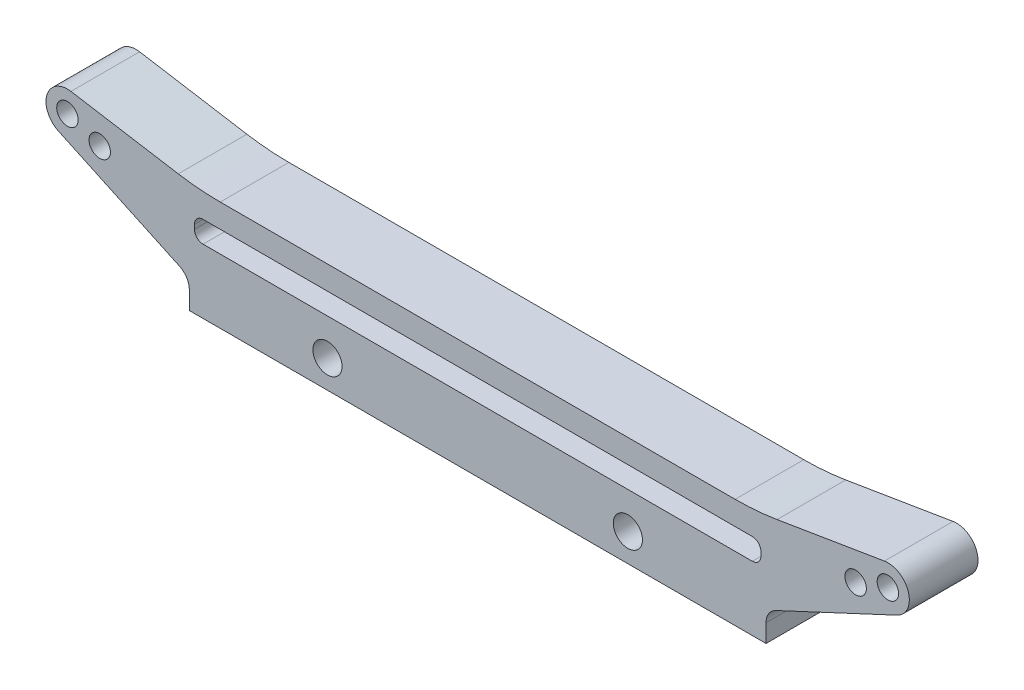
ISO-10303-21;
HEADER;
FILE_DESCRIPTION(('STEP AP214'),'2;1');
FILE_NAME('part.step','',(''),(''),'','','');
FILE_SCHEMA(('AUTOMOTIVE_DESIGN { 1 0 10303 214 1 1 1 1 }'));
ENDSEC;
DATA;
#1=APPLICATION_CONTEXT('core data for automotive mechanical design processes');
#2=APPLICATION_PROTOCOL_DEFINITION('international standard','automotive_design',2000,#1);
#3=PRODUCT_CONTEXT('',#1,'mechanical');
#4=PRODUCT('Part','Part','',(#3));
#5=PRODUCT_RELATED_PRODUCT_CATEGORY('part','',(#4));
#6=PRODUCT_DEFINITION_FORMATION('','',#4);
#7=PRODUCT_DEFINITION_CONTEXT('part definition',#1,'design');
#8=PRODUCT_DEFINITION('design','',#6,#7);
#9=PRODUCT_DEFINITION_SHAPE('','',#8);
#10=(LENGTH_UNIT() NAMED_UNIT(*) SI_UNIT(.MILLI.,.METRE.));
#11=(NAMED_UNIT(*) PLANE_ANGLE_UNIT() SI_UNIT($,.RADIAN.));
#12=(NAMED_UNIT(*) SI_UNIT($,.STERADIAN.) SOLID_ANGLE_UNIT());
#13=UNCERTAINTY_MEASURE_WITH_UNIT(LENGTH_MEASURE(1.E-05),#10,'distance_accuracy_value','');
#14=(GEOMETRIC_REPRESENTATION_CONTEXT(3) GLOBAL_UNCERTAINTY_ASSIGNED_CONTEXT((#13)) GLOBAL_UNIT_ASSIGNED_CONTEXT((#10,
#11,#12)) REPRESENTATION_CONTEXT('',''));
#15=CARTESIAN_POINT('',(0.,0.,0.));
#16=DIRECTION('',(0.,0.,1.));
#17=DIRECTION('',(1.,0.,0.));
#18=AXIS2_PLACEMENT_3D('',#15,#16,#17);
#19=CARTESIAN_POINT('',(-35.6,2.34584593517792,8.));
#20=DIRECTION('',(0.,0.,-1.));
#21=DIRECTION('',(-1.,0.,0.));
#22=AXIS2_PLACEMENT_3D('',#19,#20,#21);
#23=PLANE('',#22);
#24=CARTESIAN_POINT('',(-47.8,13.,8.));
#25=DIRECTION('',(0.,0.,1.));
#26=DIRECTION('',(1.,0.,0.));
#27=AXIS2_PLACEMENT_3D('',#24,#25,#26);
#28=CIRCLE('',#27,1.24999999999999);
#29=CARTESIAN_POINT('',(-46.55,13.,8.));
#30=VERTEX_POINT('',#29);
#31=EDGE_CURVE('E319',#30,#30,#28,.T.);
#32=ORIENTED_EDGE('',*,*,#31,.F.);
#33=EDGE_LOOP('',(#32));
#34=FACE_BOUND('',#33,.T.);
#35=CARTESIAN_POINT('',(47.8,13.,8.));
#36=DIRECTION('',(0.,0.,1.));
#37=DIRECTION('',(1.,0.,0.));
#38=AXIS2_PLACEMENT_3D('',#35,#36,#37);
#39=CIRCLE('',#38,1.24999999999999);
#40=CARTESIAN_POINT('',(49.05,13.,8.));
#41=VERTEX_POINT('',#40);
#42=EDGE_CURVE('E327',#41,#41,#39,.T.);
#43=ORIENTED_EDGE('',*,*,#42,.F.);
#44=EDGE_LOOP('',(#43));
#45=FACE_BOUND('',#44,.T.);
#46=CARTESIAN_POINT('',(-44.0412295168564,11.6319194266973,8.));
#47=DIRECTION('',(0.,0.,1.));
#48=DIRECTION('',(1.,0.,0.));
#49=AXIS2_PLACEMENT_3D('',#46,#47,#48);
#50=CIRCLE('',#49,1.24999999999999);
#51=CARTESIAN_POINT('',(-42.7912295168564,11.6319194266973,8.));
#52=VERTEX_POINT('',#51);
#53=EDGE_CURVE('E333',#52,#52,#50,.T.);
#54=ORIENTED_EDGE('',*,*,#53,.F.);
#55=EDGE_LOOP('',(#54));
#56=FACE_BOUND('',#55,.T.);
#57=CARTESIAN_POINT('',(44.0412295168564,11.6319194266973,8.));
#58=DIRECTION('',(0.,0.,1.));
#59=DIRECTION('',(1.,0.,0.));
#60=AXIS2_PLACEMENT_3D('',#57,#58,#59);
#61=CIRCLE('',#60,1.24999999999999);
#62=CARTESIAN_POINT('',(45.2912295168564,11.6319194266973,8.));
#63=VERTEX_POINT('',#62);
#64=EDGE_CURVE('E339',#63,#63,#61,.T.);
#65=ORIENTED_EDGE('',*,*,#64,.F.);
#66=EDGE_LOOP('',(#65));
#67=FACE_BOUND('',#66,.T.);
#68=CARTESIAN_POINT('',(-17.5,3.5,8.));
#69=DIRECTION('',(0.,0.,1.));
#70=DIRECTION('',(1.,0.,0.));
#71=AXIS2_PLACEMENT_3D('',#68,#69,#70);
#72=CIRCLE('',#71,1.7);
#73=CARTESIAN_POINT('',(-15.8,3.5,8.));
#74=VERTEX_POINT('',#73);
#75=EDGE_CURVE('E345',#74,#74,#72,.T.);
#76=ORIENTED_EDGE('',*,*,#75,.F.);
#77=EDGE_LOOP('',(#76));
#78=FACE_BOUND('',#77,.T.);
#79=CARTESIAN_POINT('',(17.5,3.5,8.));
#80=DIRECTION('',(0.,0.,1.));
#81=DIRECTION('',(1.,0.,0.));
#82=AXIS2_PLACEMENT_3D('',#79,#80,#81);
#83=CIRCLE('',#82,1.7);
#84=CARTESIAN_POINT('',(19.2,3.5,8.));
#85=VERTEX_POINT('',#84);
#86=EDGE_CURVE('E351',#85,#85,#83,.T.);
#87=ORIENTED_EDGE('',*,*,#86,.F.);
#88=EDGE_LOOP('',(#87));
#89=FACE_BOUND('',#88,.T.);
#90=DIRECTION('',(0.,-1.,0.));
#91=VECTOR('',#90,1.);
#92=CARTESIAN_POINT('',(-33.6,0.,8.));
#93=LINE('',#92,#91);
#94=CARTESIAN_POINT('',(-33.6,2.34584593517792,8.));
#95=VERTEX_POINT('',#94);
#96=CARTESIAN_POINT('',(-33.6,0.25,8.));
#97=VERTEX_POINT('',#96);
#98=EDGE_CURVE('E310',#95,#97,#93,.T.);
#99=ORIENTED_EDGE('',*,*,#98,.T.);
#100=DIRECTION('',(-1.,0.,0.));
#101=VECTOR('',#100,1.);
#102=CARTESIAN_POINT('',(-33.6,0.25,8.));
#103=LINE('',#102,#101);
#104=CARTESIAN_POINT('',(33.6,0.25,8.));
#105=VERTEX_POINT('',#104);
#106=EDGE_CURVE('E184',#105,#97,#103,.T.);
#107=ORIENTED_EDGE('',*,*,#106,.F.);
#108=DIRECTION('',(0.,1.,0.));
#109=VECTOR('',#108,1.);
#110=CARTESIAN_POINT('',(33.6,0.,8.));
#111=LINE('',#110,#109);
#112=CARTESIAN_POINT('',(33.6,2.34584593517792,8.));
#113=VERTEX_POINT('',#112);
#114=EDGE_CURVE('E312',#105,#113,#111,.T.);
#115=ORIENTED_EDGE('',*,*,#114,.T.);
#116=CARTESIAN_POINT('',(35.6,2.34584593517792,8.));
#117=DIRECTION('',(0.,0.,-1.));
#118=DIRECTION('',(1.,0.,0.));
#119=AXIS2_PLACEMENT_3D('',#116,#117,#118);
#120=CIRCLE('',#119,2.);
#121=CARTESIAN_POINT('',(34.7547634765186,4.15846150925123,8.));
#122=VERTEX_POINT('',#121);
#123=EDGE_CURVE('E266',#113,#122,#120,.T.);
#124=ORIENTED_EDGE('',*,*,#123,.T.);
#125=DIRECTION('',(0.906307787036653,0.422618261740694,0.));
#126=VECTOR('',#125,1.);
#127=CARTESIAN_POINT('',(34.7547634765186,4.15846150925123,8.));
#128=LINE('',#127,#126);
#129=CARTESIAN_POINT('',(48.8565456543517,10.7342305324084,8.));
#130=VERTEX_POINT('',#129);
#131=EDGE_CURVE('E284',#122,#130,#128,.T.);
#132=ORIENTED_EDGE('',*,*,#131,.T.);
#133=CARTESIAN_POINT('',(47.8,13.,8.));
#134=DIRECTION('',(0.,0.,1.));
#135=DIRECTION('',(-1.,0.,0.));
#136=AXIS2_PLACEMENT_3D('',#133,#134,#135);
#137=CIRCLE('',#136,2.5);
#138=CARTESIAN_POINT('',(47.3925354388118,15.4665710270283,8.));
#139=VERTEX_POINT('',#138);
#140=EDGE_CURVE('E280',#130,#139,#137,.T.);
#141=ORIENTED_EDGE('',*,*,#140,.T.);
#142=DIRECTION('',(-0.986628410811345,-0.162985824475262,0.));
#143=VECTOR('',#142,1.);
#144=CARTESIAN_POINT('',(47.3925354388118,15.4665710270283,8.));
#145=LINE('',#144,#143);
#146=CARTESIAN_POINT('',(34.8895747342579,13.4011476756597,8.));
#147=VERTEX_POINT('',#146);
#148=EDGE_CURVE('E283',#139,#147,#145,.T.);
#149=ORIENTED_EDGE('',*,*,#148,.T.);
#150=CARTESIAN_POINT('',(30.,43.,8.));
#151=DIRECTION('',(0.,0.,-1.));
#152=DIRECTION('',(-1.,0.,0.));
#153=AXIS2_PLACEMENT_3D('',#150,#151,#152);
#154=CIRCLE('',#153,30.);
#155=CARTESIAN_POINT('',(30.,13.,8.));
#156=VERTEX_POINT('',#155);
#157=EDGE_CURVE('E286',#147,#156,#154,.T.);
#158=ORIENTED_EDGE('',*,*,#157,.T.);
#159=DIRECTION('',(-1.,0.,0.));
#160=VECTOR('',#159,1.);
#161=CARTESIAN_POINT('',(-30.,13.,8.));
#162=LINE('',#161,#160);
#163=CARTESIAN_POINT('',(-30.,13.,8.));
#164=VERTEX_POINT('',#163);
#165=EDGE_CURVE('E292',#156,#164,#162,.T.);
#166=ORIENTED_EDGE('',*,*,#165,.T.);
#167=CARTESIAN_POINT('',(-30.,43.,8.));
#168=DIRECTION('',(0.,0.,-1.));
#169=DIRECTION('',(1.,0.,0.));
#170=AXIS2_PLACEMENT_3D('',#167,#168,#169);
#171=CIRCLE('',#170,30.);
#172=CARTESIAN_POINT('',(-34.8895747342579,13.4011476756597,8.));
#173=VERTEX_POINT('',#172);
#174=EDGE_CURVE('E294',#164,#173,#171,.T.);
#175=ORIENTED_EDGE('',*,*,#174,.T.);
#176=DIRECTION('',(-0.986628410811345,0.162985824475262,0.));
#177=VECTOR('',#176,1.);
#178=CARTESIAN_POINT('',(-47.3925354388118,15.4665710270283,8.));
#179=LINE('',#178,#177);
#180=CARTESIAN_POINT('',(-47.3925354388118,15.4665710270284,8.));
#181=VERTEX_POINT('',#180);
#182=EDGE_CURVE('E296',#173,#181,#179,.T.);
#183=ORIENTED_EDGE('',*,*,#182,.T.);
#184=CARTESIAN_POINT('',(-47.8,13.,8.));
#185=DIRECTION('',(0.,0.,1.));
#186=DIRECTION('',(1.,0.,0.));
#187=AXIS2_PLACEMENT_3D('',#184,#185,#186);
#188=CIRCLE('',#187,2.5);
#189=CARTESIAN_POINT('',(-48.8565456543517,10.7342305324084,8.));
#190=VERTEX_POINT('',#189);
#191=EDGE_CURVE('E298',#181,#190,#188,.T.);
#192=ORIENTED_EDGE('',*,*,#191,.T.);
#193=DIRECTION('',(0.906307787036653,-0.422618261740694,0.));
#194=VECTOR('',#193,1.);
#195=CARTESIAN_POINT('',(-34.7547634765186,4.15846150925123,8.));
#196=LINE('',#195,#194);
#197=CARTESIAN_POINT('',(-34.7547634765186,4.15846150925123,8.));
#198=VERTEX_POINT('',#197);
#199=EDGE_CURVE('E234',#190,#198,#196,.T.);
#200=ORIENTED_EDGE('',*,*,#199,.T.);
#201=CARTESIAN_POINT('',(-35.6,2.34584593517792,8.));
#202=DIRECTION('',(0.,0.,-1.));
#203=DIRECTION('',(-1.,0.,0.));
#204=AXIS2_PLACEMENT_3D('',#201,#202,#203);
#205=CIRCLE('',#204,2.);
#206=EDGE_CURVE('E229',#198,#95,#205,.T.);
#207=ORIENTED_EDGE('',*,*,#206,.T.);
#208=EDGE_LOOP('',(#99,#107,#115,#124,#132,#141,#149,#158,#166,#175,#183,#192,#200,#207));
#209=FACE_BOUND('',#208,.T.);
#210=CARTESIAN_POINT('',(-32.,9.25000000000001,8.));
#211=DIRECTION('',(0.,0.,1.));
#212=DIRECTION('',(1.,0.,0.));
#213=AXIS2_PLACEMENT_3D('',#210,#211,#212);
#214=CIRCLE('',#213,1.);
#215=CARTESIAN_POINT('',(-32.,10.25,8.));
#216=VERTEX_POINT('',#215);
#217=CARTESIAN_POINT('',(-33.,9.25000000000001,8.));
#218=VERTEX_POINT('',#217);
#219=EDGE_CURVE('E358',#216,#218,#214,.T.);
#220=ORIENTED_EDGE('',*,*,#219,.F.);
#221=DIRECTION('',(-1.,0.,0.));
#222=VECTOR('',#221,1.);
#223=CARTESIAN_POINT('',(-32.,10.25,8.));
#224=LINE('',#223,#222);
#225=CARTESIAN_POINT('',(32.,10.25,8.));
#226=VERTEX_POINT('',#225);
#227=EDGE_CURVE('E373',#226,#216,#224,.T.);
#228=ORIENTED_EDGE('',*,*,#227,.F.);
#229=CARTESIAN_POINT('',(32.,9.25000000000001,8.));
#230=DIRECTION('',(0.,0.,1.));
#231=DIRECTION('',(-1.,0.,0.));
#232=AXIS2_PLACEMENT_3D('',#229,#230,#231);
#233=CIRCLE('',#232,1.);
#234=CARTESIAN_POINT('',(33.,9.25000000000001,8.));
#235=VERTEX_POINT('',#234);
#236=EDGE_CURVE('E371',#235,#226,#233,.T.);
#237=ORIENTED_EDGE('',*,*,#236,.F.);
#238=DIRECTION('',(0.,1.,0.));
#239=VECTOR('',#238,1.);
#240=CARTESIAN_POINT('',(33.,8.75,8.));
#241=LINE('',#240,#239);
#242=CARTESIAN_POINT('',(33.,8.75,8.));
#243=VERTEX_POINT('',#242);
#244=EDGE_CURVE('E369',#243,#235,#241,.T.);
#245=ORIENTED_EDGE('',*,*,#244,.F.);
#246=CARTESIAN_POINT('',(32.,8.75,8.));
#247=DIRECTION('',(0.,0.,1.));
#248=DIRECTION('',(1.,0.,0.));
#249=AXIS2_PLACEMENT_3D('',#246,#247,#248);
#250=CIRCLE('',#249,1.);
#251=CARTESIAN_POINT('',(32.,7.75,8.));
#252=VERTEX_POINT('',#251);
#253=EDGE_CURVE('E367',#252,#243,#250,.T.);
#254=ORIENTED_EDGE('',*,*,#253,.F.);
#255=DIRECTION('',(1.,0.,0.));
#256=VECTOR('',#255,1.);
#257=CARTESIAN_POINT('',(32.,7.75,8.));
#258=LINE('',#257,#256);
#259=CARTESIAN_POINT('',(-32.,7.75,8.));
#260=VERTEX_POINT('',#259);
#261=EDGE_CURVE('E365',#260,#252,#258,.T.);
#262=ORIENTED_EDGE('',*,*,#261,.F.);
#263=CARTESIAN_POINT('',(-32.,8.75,8.));
#264=DIRECTION('',(0.,0.,1.));
#265=DIRECTION('',(-1.,0.,0.));
#266=AXIS2_PLACEMENT_3D('',#263,#264,#265);
#267=CIRCLE('',#266,1.);
#268=CARTESIAN_POINT('',(-33.,8.75,8.));
#269=VERTEX_POINT('',#268);
#270=EDGE_CURVE('E363',#269,#260,#267,.T.);
#271=ORIENTED_EDGE('',*,*,#270,.F.);
#272=DIRECTION('',(0.,-1.,0.));
#273=VECTOR('',#272,1.);
#274=CARTESIAN_POINT('',(-33.,8.75,8.));
#275=LINE('',#274,#273);
#276=EDGE_CURVE('E360',#218,#269,#275,.T.);
#277=ORIENTED_EDGE('',*,*,#276,.F.);
#278=EDGE_LOOP('',(#220,#228,#237,#245,#254,#262,#271,#277));
#279=FACE_BOUND('',#278,.T.);
#280=ADVANCED_FACE('F34',(#34,#45,#56,#67,#78,#89,#209,#279),#23,.F.);
#281=CARTESIAN_POINT('',(-35.6,2.34584593517792,0.));
#282=DIRECTION('',(0.,0.,-1.));
#283=DIRECTION('',(-1.,0.,0.));
#284=AXIS2_PLACEMENT_3D('',#281,#282,#283);
#285=PLANE('',#284);
#286=DIRECTION('',(1.,0.,0.));
#287=VECTOR('',#286,1.);
#288=CARTESIAN_POINT('',(-33.6,0.25,0.));
#289=LINE('',#288,#287);
#290=CARTESIAN_POINT('',(-33.6,0.25,0.));
#291=VERTEX_POINT('',#290);
#292=CARTESIAN_POINT('',(33.6,0.25,0.));
#293=VERTEX_POINT('',#292);
#294=EDGE_CURVE('E49',#291,#293,#289,.T.);
#295=ORIENTED_EDGE('',*,*,#294,.F.);
#296=DIRECTION('',(0.,-1.,0.));
#297=VECTOR('',#296,1.);
#298=CARTESIAN_POINT('',(-33.6,0.,0.));
#299=LINE('',#298,#297);
#300=CARTESIAN_POINT('',(-33.6,2.34584593517792,0.));
#301=VERTEX_POINT('',#300);
#302=EDGE_CURVE('E194',#301,#291,#299,.T.);
#303=ORIENTED_EDGE('',*,*,#302,.F.);
#304=CARTESIAN_POINT('',(-35.6,2.34584593517792,0.));
#305=DIRECTION('',(0.,0.,-1.));
#306=DIRECTION('',(-1.,0.,0.));
#307=AXIS2_PLACEMENT_3D('',#304,#305,#306);
#308=CIRCLE('',#307,2.);
#309=CARTESIAN_POINT('',(-34.7547634765186,4.15846150925123,0.));
#310=VERTEX_POINT('',#309);
#311=EDGE_CURVE('E202',#310,#301,#308,.T.);
#312=ORIENTED_EDGE('',*,*,#311,.F.);
#313=DIRECTION('',(0.906307787036653,-0.422618261740694,0.));
#314=VECTOR('',#313,1.);
#315=CARTESIAN_POINT('',(-34.7547634765186,4.15846150925123,0.));
#316=LINE('',#315,#314);
#317=CARTESIAN_POINT('',(-48.8565456543517,10.7342305324084,0.));
#318=VERTEX_POINT('',#317);
#319=EDGE_CURVE('E227',#318,#310,#316,.T.);
#320=ORIENTED_EDGE('',*,*,#319,.F.);
#321=CARTESIAN_POINT('',(-47.8,13.,0.));
#322=DIRECTION('',(0.,0.,1.));
#323=DIRECTION('',(1.,0.,0.));
#324=AXIS2_PLACEMENT_3D('',#321,#322,#323);
#325=CIRCLE('',#324,2.5);
#326=CARTESIAN_POINT('',(-47.3925354388118,15.4665710270284,0.));
#327=VERTEX_POINT('',#326);
#328=EDGE_CURVE('E225',#327,#318,#325,.T.);
#329=ORIENTED_EDGE('',*,*,#328,.F.);
#330=DIRECTION('',(-0.986628410811345,0.162985824475262,0.));
#331=VECTOR('',#330,1.);
#332=CARTESIAN_POINT('',(-47.3925354388118,15.4665710270283,0.));
#333=LINE('',#332,#331);
#334=CARTESIAN_POINT('',(-34.8895747342579,13.4011476756597,0.));
#335=VERTEX_POINT('',#334);
#336=EDGE_CURVE('E223',#335,#327,#333,.T.);
#337=ORIENTED_EDGE('',*,*,#336,.F.);
#338=CARTESIAN_POINT('',(-30.,43.,0.));
#339=DIRECTION('',(0.,0.,-1.));
#340=DIRECTION('',(1.,0.,0.));
#341=AXIS2_PLACEMENT_3D('',#338,#339,#340);
#342=CIRCLE('',#341,30.);
#343=CARTESIAN_POINT('',(-30.,13.,0.));
#344=VERTEX_POINT('',#343);
#345=EDGE_CURVE('E221',#344,#335,#342,.T.);
#346=ORIENTED_EDGE('',*,*,#345,.F.);
#347=DIRECTION('',(-1.,0.,0.));
#348=VECTOR('',#347,1.);
#349=CARTESIAN_POINT('',(-30.,13.,0.));
#350=LINE('',#349,#348);
#351=CARTESIAN_POINT('',(30.,13.,0.));
#352=VERTEX_POINT('',#351);
#353=EDGE_CURVE('E219',#352,#344,#350,.T.);
#354=ORIENTED_EDGE('',*,*,#353,.F.);
#355=CARTESIAN_POINT('',(30.,43.,0.));
#356=DIRECTION('',(0.,0.,-1.));
#357=DIRECTION('',(-1.,0.,0.));
#358=AXIS2_PLACEMENT_3D('',#355,#356,#357);
#359=CIRCLE('',#358,30.);
#360=CARTESIAN_POINT('',(34.8895747342579,13.4011476756597,0.));
#361=VERTEX_POINT('',#360);
#362=EDGE_CURVE('E217',#361,#352,#359,.T.);
#363=ORIENTED_EDGE('',*,*,#362,.F.);
#364=DIRECTION('',(-0.986628410811345,-0.162985824475262,0.));
#365=VECTOR('',#364,1.);
#366=CARTESIAN_POINT('',(47.3925354388118,15.4665710270283,0.));
#367=LINE('',#366,#365);
#368=CARTESIAN_POINT('',(47.3925354388118,15.4665710270283,0.));
#369=VERTEX_POINT('',#368);
#370=EDGE_CURVE('E215',#369,#361,#367,.T.);
#371=ORIENTED_EDGE('',*,*,#370,.F.);
#372=CARTESIAN_POINT('',(47.8,13.,0.));
#373=DIRECTION('',(0.,0.,1.));
#374=DIRECTION('',(-1.,0.,0.));
#375=AXIS2_PLACEMENT_3D('',#372,#373,#374);
#376=CIRCLE('',#375,2.5);
#377=CARTESIAN_POINT('',(48.8565456543517,10.7342305324084,0.));
#378=VERTEX_POINT('',#377);
#379=EDGE_CURVE('E213',#378,#369,#376,.T.);
#380=ORIENTED_EDGE('',*,*,#379,.F.);
#381=DIRECTION('',(0.906307787036653,0.422618261740694,0.));
#382=VECTOR('',#381,1.);
#383=CARTESIAN_POINT('',(34.7547634765186,4.15846150925123,0.));
#384=LINE('',#383,#382);
#385=CARTESIAN_POINT('',(34.7547634765186,4.15846150925123,0.));
#386=VERTEX_POINT('',#385);
#387=EDGE_CURVE('E211',#386,#378,#384,.T.);
#388=ORIENTED_EDGE('',*,*,#387,.F.);
#389=CARTESIAN_POINT('',(35.6,2.34584593517792,0.));
#390=DIRECTION('',(0.,0.,-1.));
#391=DIRECTION('',(1.,0.,0.));
#392=AXIS2_PLACEMENT_3D('',#389,#390,#391);
#393=CIRCLE('',#392,2.);
#394=CARTESIAN_POINT('',(33.6,2.34584593517792,0.));
#395=VERTEX_POINT('',#394);
#396=EDGE_CURVE('E204',#395,#386,#393,.T.);
#397=ORIENTED_EDGE('',*,*,#396,.F.);
#398=DIRECTION('',(0.,1.,0.));
#399=VECTOR('',#398,1.);
#400=CARTESIAN_POINT('',(33.6,0.,0.));
#401=LINE('',#400,#399);
#402=EDGE_CURVE('E196',#293,#395,#401,.T.);
#403=ORIENTED_EDGE('',*,*,#402,.F.);
#404=EDGE_LOOP('',(#295,#303,#312,#320,#329,#337,#346,#354,#363,#371,#380,#388,#397,#403));
#405=FACE_BOUND('',#404,.T.);
#406=CARTESIAN_POINT('',(-47.8,13.,0.));
#407=DIRECTION('',(0.,0.,1.));
#408=DIRECTION('',(1.,0.,0.));
#409=AXIS2_PLACEMENT_3D('',#406,#407,#408);
#410=CIRCLE('',#409,1.25);
#411=CARTESIAN_POINT('',(-46.55,13.,0.));
#412=VERTEX_POINT('',#411);
#413=EDGE_CURVE('E324',#412,#412,#410,.T.);
#414=ORIENTED_EDGE('',*,*,#413,.T.);
#415=EDGE_LOOP('',(#414));
#416=FACE_BOUND('',#415,.T.);
#417=CARTESIAN_POINT('',(47.8,13.,0.));
#418=DIRECTION('',(0.,0.,1.));
#419=DIRECTION('',(1.,0.,0.));
#420=AXIS2_PLACEMENT_3D('',#417,#418,#419);
#421=CIRCLE('',#420,1.25);
#422=CARTESIAN_POINT('',(49.05,13.,0.));
#423=VERTEX_POINT('',#422);
#424=EDGE_CURVE('E330',#423,#423,#421,.T.);
#425=ORIENTED_EDGE('',*,*,#424,.T.);
#426=EDGE_LOOP('',(#425));
#427=FACE_BOUND('',#426,.T.);
#428=CARTESIAN_POINT('',(-44.0412295168564,11.6319194266973,0.));
#429=DIRECTION('',(0.,0.,1.));
#430=DIRECTION('',(1.,0.,0.));
#431=AXIS2_PLACEMENT_3D('',#428,#429,#430);
#432=CIRCLE('',#431,1.25);
#433=CARTESIAN_POINT('',(-42.7912295168564,11.6319194266973,0.));
#434=VERTEX_POINT('',#433);
#435=EDGE_CURVE('E336',#434,#434,#432,.T.);
#436=ORIENTED_EDGE('',*,*,#435,.T.);
#437=EDGE_LOOP('',(#436));
#438=FACE_BOUND('',#437,.T.);
#439=CARTESIAN_POINT('',(44.0412295168564,11.6319194266973,0.));
#440=DIRECTION('',(0.,0.,1.));
#441=DIRECTION('',(1.,0.,0.));
#442=AXIS2_PLACEMENT_3D('',#439,#440,#441);
#443=CIRCLE('',#442,1.25);
#444=CARTESIAN_POINT('',(45.2912295168564,11.6319194266973,0.));
#445=VERTEX_POINT('',#444);
#446=EDGE_CURVE('E342',#445,#445,#443,.T.);
#447=ORIENTED_EDGE('',*,*,#446,.T.);
#448=EDGE_LOOP('',(#447));
#449=FACE_BOUND('',#448,.T.);
#450=CARTESIAN_POINT('',(-17.5,3.5,0.));
#451=DIRECTION('',(0.,0.,1.));
#452=DIRECTION('',(1.,0.,0.));
#453=AXIS2_PLACEMENT_3D('',#450,#451,#452);
#454=CIRCLE('',#453,1.7);
#455=CARTESIAN_POINT('',(-15.8,3.5,0.));
#456=VERTEX_POINT('',#455);
#457=EDGE_CURVE('E348',#456,#456,#454,.T.);
#458=ORIENTED_EDGE('',*,*,#457,.T.);
#459=EDGE_LOOP('',(#458));
#460=FACE_BOUND('',#459,.T.);
#461=CARTESIAN_POINT('',(17.5,3.5,0.));
#462=DIRECTION('',(0.,0.,1.));
#463=DIRECTION('',(1.,0.,0.));
#464=AXIS2_PLACEMENT_3D('',#461,#462,#463);
#465=CIRCLE('',#464,1.7);
#466=CARTESIAN_POINT('',(19.2,3.5,0.));
#467=VERTEX_POINT('',#466);
#468=EDGE_CURVE('E354',#467,#467,#465,.T.);
#469=ORIENTED_EDGE('',*,*,#468,.T.);
#470=EDGE_LOOP('',(#469));
#471=FACE_BOUND('',#470,.T.);
#472=DIRECTION('',(-1.,0.,0.));
#473=VECTOR('',#472,1.);
#474=CARTESIAN_POINT('',(-32.,10.25,0.));
#475=LINE('',#474,#473);
#476=CARTESIAN_POINT('',(32.,10.25,0.));
#477=VERTEX_POINT('',#476);
#478=CARTESIAN_POINT('',(-32.,10.25,0.));
#479=VERTEX_POINT('',#478);
#480=EDGE_CURVE('E361',#477,#479,#475,.T.);
#481=ORIENTED_EDGE('',*,*,#480,.T.);
#482=CARTESIAN_POINT('',(-32.,9.25000000000001,0.));
#483=DIRECTION('',(0.,0.,1.));
#484=DIRECTION('',(1.,0.,0.));
#485=AXIS2_PLACEMENT_3D('',#482,#483,#484);
#486=CIRCLE('',#485,1.);
#487=CARTESIAN_POINT('',(-33.,9.25000000000001,0.));
#488=VERTEX_POINT('',#487);
#489=EDGE_CURVE('E357',#479,#488,#486,.T.);
#490=ORIENTED_EDGE('',*,*,#489,.T.);
#491=DIRECTION('',(0.,-1.,0.));
#492=VECTOR('',#491,1.);
#493=CARTESIAN_POINT('',(-33.,8.75,0.));
#494=LINE('',#493,#492);
#495=CARTESIAN_POINT('',(-33.,8.75,0.));
#496=VERTEX_POINT('',#495);
#497=EDGE_CURVE('E378',#488,#496,#494,.T.);
#498=ORIENTED_EDGE('',*,*,#497,.T.);
#499=CARTESIAN_POINT('',(-32.,8.75,0.));
#500=DIRECTION('',(0.,0.,1.));
#501=DIRECTION('',(-1.,0.,0.));
#502=AXIS2_PLACEMENT_3D('',#499,#500,#501);
#503=CIRCLE('',#502,1.);
#504=CARTESIAN_POINT('',(-32.,7.75,0.));
#505=VERTEX_POINT('',#504);
#506=EDGE_CURVE('E381',#496,#505,#503,.T.);
#507=ORIENTED_EDGE('',*,*,#506,.T.);
#508=DIRECTION('',(1.,0.,0.));
#509=VECTOR('',#508,1.);
#510=CARTESIAN_POINT('',(32.,7.75,0.));
#511=LINE('',#510,#509);
#512=CARTESIAN_POINT('',(32.,7.75,0.));
#513=VERTEX_POINT('',#512);
#514=EDGE_CURVE('E384',#505,#513,#511,.T.);
#515=ORIENTED_EDGE('',*,*,#514,.T.);
#516=CARTESIAN_POINT('',(32.,8.75,0.));
#517=DIRECTION('',(0.,0.,1.));
#518=DIRECTION('',(1.,0.,0.));
#519=AXIS2_PLACEMENT_3D('',#516,#517,#518);
#520=CIRCLE('',#519,1.);
#521=CARTESIAN_POINT('',(33.,8.75,0.));
#522=VERTEX_POINT('',#521);
#523=EDGE_CURVE('E387',#513,#522,#520,.T.);
#524=ORIENTED_EDGE('',*,*,#523,.T.);
#525=DIRECTION('',(0.,1.,0.));
#526=VECTOR('',#525,1.);
#527=CARTESIAN_POINT('',(33.,8.75,0.));
#528=LINE('',#527,#526);
#529=CARTESIAN_POINT('',(33.,9.25000000000001,0.));
#530=VERTEX_POINT('',#529);
#531=EDGE_CURVE('E390',#522,#530,#528,.T.);
#532=ORIENTED_EDGE('',*,*,#531,.T.);
#533=CARTESIAN_POINT('',(32.,9.25000000000001,0.));
#534=DIRECTION('',(0.,0.,1.));
#535=DIRECTION('',(-1.,0.,0.));
#536=AXIS2_PLACEMENT_3D('',#533,#534,#535);
#537=CIRCLE('',#536,1.);
#538=EDGE_CURVE('E393',#530,#477,#537,.T.);
#539=ORIENTED_EDGE('',*,*,#538,.T.);
#540=EDGE_LOOP('',(#481,#490,#498,#507,#515,#524,#532,#539));
#541=FACE_BOUND('',#540,.T.);
#542=ADVANCED_FACE('F191',(#405,#416,#427,#438,#449,#460,#471,#541),#285,.T.);
#543=CARTESIAN_POINT('',(-35.6,2.34584593517792,8.));
#544=DIRECTION('',(0.,0.,-1.));
#545=DIRECTION('',(-1.,0.,0.));
#546=AXIS2_PLACEMENT_3D('',#543,#544,#545);
#547=CYLINDRICAL_SURFACE('',#546,2.);
#548=ORIENTED_EDGE('',*,*,#311,.T.);
#549=DIRECTION('',(0.,0.,-1.));
#550=VECTOR('',#549,1.);
#551=CARTESIAN_POINT('',(-33.6,2.34584593517792,8.));
#552=LINE('',#551,#550);
#553=EDGE_CURVE('E11',#95,#301,#552,.T.);
#554=ORIENTED_EDGE('',*,*,#553,.F.);
#555=ORIENTED_EDGE('',*,*,#206,.F.);
#556=DIRECTION('',(0.,0.,-1.));
#557=VECTOR('',#556,1.);
#558=CARTESIAN_POINT('',(-34.7547634765186,4.15846150925123,8.));
#559=LINE('',#558,#557);
#560=EDGE_CURVE('E230',#198,#310,#559,.T.);
#561=ORIENTED_EDGE('',*,*,#560,.T.);
#562=EDGE_LOOP('',(#548,#554,#555,#561));
#563=FACE_BOUND('',#562,.T.);
#564=ADVANCED_FACE('F36',(#563),#547,.F.);
#565=CARTESIAN_POINT('',(-33.6,0.,8.));
#566=DIRECTION('',(1.,0.,0.));
#567=DIRECTION('',(0.,0.,-1.));
#568=AXIS2_PLACEMENT_3D('',#565,#566,#567);
#569=PLANE('',#568);
#570=ORIENTED_EDGE('',*,*,#302,.T.);
#571=DIRECTION('',(0.,0.,-1.));
#572=VECTOR('',#571,1.);
#573=CARTESIAN_POINT('',(-33.6,0.25,0.));
#574=LINE('',#573,#572);
#575=EDGE_CURVE('E181',#97,#291,#574,.T.);
#576=ORIENTED_EDGE('',*,*,#575,.F.);
#577=ORIENTED_EDGE('',*,*,#98,.F.);
#578=ORIENTED_EDGE('',*,*,#553,.T.);
#579=EDGE_LOOP('',(#570,#576,#577,#578));
#580=FACE_BOUND('',#579,.T.);
#581=ADVANCED_FACE('F199',(#580),#569,.F.);
#582=CARTESIAN_POINT('',(33.6,0.,8.));
#583=DIRECTION('',(-1.,0.,0.));
#584=DIRECTION('',(0.,0.,1.));
#585=AXIS2_PLACEMENT_3D('',#582,#583,#584);
#586=PLANE('',#585);
#587=ORIENTED_EDGE('',*,*,#114,.F.);
#588=DIRECTION('',(0.,0.,1.));
#589=VECTOR('',#588,1.);
#590=CARTESIAN_POINT('',(33.6,0.25,0.));
#591=LINE('',#590,#589);
#592=EDGE_CURVE('E197',#293,#105,#591,.T.);
#593=ORIENTED_EDGE('',*,*,#592,.F.);
#594=ORIENTED_EDGE('',*,*,#402,.T.);
#595=DIRECTION('',(0.,0.,-1.));
#596=VECTOR('',#595,1.);
#597=CARTESIAN_POINT('',(33.6,2.34584593517792,8.));
#598=LINE('',#597,#596);
#599=EDGE_CURVE('E42',#113,#395,#598,.T.);
#600=ORIENTED_EDGE('',*,*,#599,.F.);
#601=EDGE_LOOP('',(#587,#593,#594,#600));
#602=FACE_BOUND('',#601,.T.);
#603=ADVANCED_FACE('F317',(#602),#586,.F.);
#604=CARTESIAN_POINT('',(35.6,2.34584593517792,8.));
#605=DIRECTION('',(0.,0.,-1.));
#606=DIRECTION('',(-1.,0.,0.));
#607=AXIS2_PLACEMENT_3D('',#604,#605,#606);
#608=CYLINDRICAL_SURFACE('',#607,2.);
#609=ORIENTED_EDGE('',*,*,#396,.T.);
#610=DIRECTION('',(0.,0.,-1.));
#611=VECTOR('',#610,1.);
#612=CARTESIAN_POINT('',(34.7547634765186,4.15846150925123,8.));
#613=LINE('',#612,#611);
#614=EDGE_CURVE('E258',#122,#386,#613,.T.);
#615=ORIENTED_EDGE('',*,*,#614,.F.);
#616=ORIENTED_EDGE('',*,*,#123,.F.);
#617=ORIENTED_EDGE('',*,*,#599,.T.);
#618=EDGE_LOOP('',(#609,#615,#616,#617));
#619=FACE_BOUND('',#618,.T.);
#620=ADVANCED_FACE('F264',(#619),#608,.F.);
#621=CARTESIAN_POINT('',(34.7547634765186,4.15846150925123,8.));
#622=DIRECTION('',(-0.422618261740693,0.906307787036653,0.));
#623=DIRECTION('',(-0.906307787036653,-0.422618261740694,0.));
#624=AXIS2_PLACEMENT_3D('',#621,#622,#623);
#625=PLANE('',#624);
#626=ORIENTED_EDGE('',*,*,#387,.T.);
#627=DIRECTION('',(0.,0.,-1.));
#628=VECTOR('',#627,1.);
#629=CARTESIAN_POINT('',(48.8565456543517,10.7342305324084,8.));
#630=LINE('',#629,#628);
#631=EDGE_CURVE('E255',#130,#378,#630,.T.);
#632=ORIENTED_EDGE('',*,*,#631,.F.);
#633=ORIENTED_EDGE('',*,*,#131,.F.);
#634=ORIENTED_EDGE('',*,*,#614,.T.);
#635=EDGE_LOOP('',(#626,#632,#633,#634));
#636=FACE_BOUND('',#635,.T.);
#637=ADVANCED_FACE('F274',(#636),#625,.F.);
#638=CARTESIAN_POINT('',(47.8,13.,8.));
#639=DIRECTION('',(0.,0.,-1.));
#640=DIRECTION('',(-1.,0.,0.));
#641=AXIS2_PLACEMENT_3D('',#638,#639,#640);
#642=CYLINDRICAL_SURFACE('',#641,2.5);
#643=ORIENTED_EDGE('',*,*,#379,.T.);
#644=DIRECTION('',(0.,0.,-1.));
#645=VECTOR('',#644,1.);
#646=CARTESIAN_POINT('',(47.3925354388118,15.4665710270283,8.));
#647=LINE('',#646,#645);
#648=EDGE_CURVE('E252',#139,#369,#647,.T.);
#649=ORIENTED_EDGE('',*,*,#648,.F.);
#650=ORIENTED_EDGE('',*,*,#140,.F.);
#651=ORIENTED_EDGE('',*,*,#631,.T.);
#652=EDGE_LOOP('',(#643,#649,#650,#651));
#653=FACE_BOUND('',#652,.T.);
#654=ADVANCED_FACE('F278',(#653),#642,.T.);
#655=CARTESIAN_POINT('',(47.3925354388118,15.4665710270283,8.));
#656=DIRECTION('',(0.162985824475262,-0.986628410811344,0.));
#657=DIRECTION('',(0.986628410811345,0.162985824475262,0.));
#658=AXIS2_PLACEMENT_3D('',#655,#656,#657);
#659=PLANE('',#658);
#660=ORIENTED_EDGE('',*,*,#370,.T.);
#661=DIRECTION('',(0.,0.,-1.));
#662=VECTOR('',#661,1.);
#663=CARTESIAN_POINT('',(34.8895747342579,13.4011476756597,8.));
#664=LINE('',#663,#662);
#665=EDGE_CURVE('E249',#147,#361,#664,.T.);
#666=ORIENTED_EDGE('',*,*,#665,.F.);
#667=ORIENTED_EDGE('',*,*,#148,.F.);
#668=ORIENTED_EDGE('',*,*,#648,.T.);
#669=EDGE_LOOP('',(#660,#666,#667,#668));
#670=FACE_BOUND('',#669,.T.);
#671=ADVANCED_FACE('F488',(#670),#659,.F.);
#672=CARTESIAN_POINT('',(30.,43.,8.));
#673=DIRECTION('',(0.,0.,-1.));
#674=DIRECTION('',(-1.,0.,0.));
#675=AXIS2_PLACEMENT_3D('',#672,#673,#674);
#676=CYLINDRICAL_SURFACE('',#675,30.);
#677=ORIENTED_EDGE('',*,*,#362,.T.);
#678=DIRECTION('',(0.,0.,-1.));
#679=VECTOR('',#678,1.);
#680=CARTESIAN_POINT('',(30.,13.,8.));
#681=LINE('',#680,#679);
#682=EDGE_CURVE('E246',#156,#352,#681,.T.);
#683=ORIENTED_EDGE('',*,*,#682,.F.);
#684=ORIENTED_EDGE('',*,*,#157,.F.);
#685=ORIENTED_EDGE('',*,*,#665,.T.);
#686=EDGE_LOOP('',(#677,#683,#684,#685));
#687=FACE_BOUND('',#686,.T.);
#688=ADVANCED_FACE('F484',(#687),#676,.F.);
#689=CARTESIAN_POINT('',(-30.,13.,8.));
#690=DIRECTION('',(0.,-1.,0.));
#691=DIRECTION('',(0.,0.,-1.));
#692=AXIS2_PLACEMENT_3D('',#689,#690,#691);
#693=PLANE('',#692);
#694=ORIENTED_EDGE('',*,*,#353,.T.);
#695=DIRECTION('',(0.,0.,-1.));
#696=VECTOR('',#695,1.);
#697=CARTESIAN_POINT('',(-30.,13.,8.));
#698=LINE('',#697,#696);
#699=EDGE_CURVE('E243',#164,#344,#698,.T.);
#700=ORIENTED_EDGE('',*,*,#699,.F.);
#701=ORIENTED_EDGE('',*,*,#165,.F.);
#702=ORIENTED_EDGE('',*,*,#682,.T.);
#703=EDGE_LOOP('',(#694,#700,#701,#702));
#704=FACE_BOUND('',#703,.T.);
#705=ADVANCED_FACE('F480',(#704),#693,.F.);
#706=CARTESIAN_POINT('',(-30.,43.,8.));
#707=DIRECTION('',(0.,0.,-1.));
#708=DIRECTION('',(-1.,0.,0.));
#709=AXIS2_PLACEMENT_3D('',#706,#707,#708);
#710=CYLINDRICAL_SURFACE('',#709,30.);
#711=ORIENTED_EDGE('',*,*,#345,.T.);
#712=DIRECTION('',(0.,0.,-1.));
#713=VECTOR('',#712,1.);
#714=CARTESIAN_POINT('',(-34.8895747342579,13.4011476756597,8.));
#715=LINE('',#714,#713);
#716=EDGE_CURVE('E240',#173,#335,#715,.T.);
#717=ORIENTED_EDGE('',*,*,#716,.F.);
#718=ORIENTED_EDGE('',*,*,#174,.F.);
#719=ORIENTED_EDGE('',*,*,#699,.T.);
#720=EDGE_LOOP('',(#711,#717,#718,#719));
#721=FACE_BOUND('',#720,.T.);
#722=ADVANCED_FACE('F476',(#721),#710,.F.);
#723=CARTESIAN_POINT('',(-47.3925354388118,15.4665710270283,8.));
#724=DIRECTION('',(-0.162985824475262,-0.986628410811344,0.));
#725=DIRECTION('',(0.986628410811345,-0.162985824475262,0.));
#726=AXIS2_PLACEMENT_3D('',#723,#724,#725);
#727=PLANE('',#726);
#728=ORIENTED_EDGE('',*,*,#336,.T.);
#729=DIRECTION('',(0.,0.,-1.));
#730=VECTOR('',#729,1.);
#731=CARTESIAN_POINT('',(-47.3925354388118,15.4665710270284,8.));
#732=LINE('',#731,#730);
#733=EDGE_CURVE('E237',#181,#327,#732,.T.);
#734=ORIENTED_EDGE('',*,*,#733,.F.);
#735=ORIENTED_EDGE('',*,*,#182,.F.);
#736=ORIENTED_EDGE('',*,*,#716,.T.);
#737=EDGE_LOOP('',(#728,#734,#735,#736));
#738=FACE_BOUND('',#737,.T.);
#739=ADVANCED_FACE('F472',(#738),#727,.F.);
#740=CARTESIAN_POINT('',(-47.8,13.,8.));
#741=DIRECTION('',(0.,0.,-1.));
#742=DIRECTION('',(-1.,0.,0.));
#743=AXIS2_PLACEMENT_3D('',#740,#741,#742);
#744=CYLINDRICAL_SURFACE('',#743,2.5);
#745=ORIENTED_EDGE('',*,*,#328,.T.);
#746=DIRECTION('',(0.,0.,-1.));
#747=VECTOR('',#746,1.);
#748=CARTESIAN_POINT('',(-48.8565456543517,10.7342305324084,8.));
#749=LINE('',#748,#747);
#750=EDGE_CURVE('E233',#190,#318,#749,.T.);
#751=ORIENTED_EDGE('',*,*,#750,.F.);
#752=ORIENTED_EDGE('',*,*,#191,.F.);
#753=ORIENTED_EDGE('',*,*,#733,.T.);
#754=EDGE_LOOP('',(#745,#751,#752,#753));
#755=FACE_BOUND('',#754,.T.);
#756=ADVANCED_FACE('F469',(#755),#744,.T.);
#757=CARTESIAN_POINT('',(-34.7547634765186,4.15846150925123,8.));
#758=DIRECTION('',(0.422618261740694,0.906307787036653,0.));
#759=DIRECTION('',(-0.906307787036653,0.422618261740694,0.));
#760=AXIS2_PLACEMENT_3D('',#757,#758,#759);
#761=PLANE('',#760);
#762=ORIENTED_EDGE('',*,*,#319,.T.);
#763=ORIENTED_EDGE('',*,*,#560,.F.);
#764=ORIENTED_EDGE('',*,*,#199,.F.);
#765=ORIENTED_EDGE('',*,*,#750,.T.);
#766=EDGE_LOOP('',(#762,#763,#764,#765));
#767=FACE_BOUND('',#766,.T.);
#768=ADVANCED_FACE('F307',(#767),#761,.F.);
#769=CARTESIAN_POINT('',(-32.,9.25000000000001,8.));
#770=DIRECTION('',(0.,0.,-1.));
#771=DIRECTION('',(-1.,0.,0.));
#772=AXIS2_PLACEMENT_3D('',#769,#770,#771);
#773=CYLINDRICAL_SURFACE('',#772,1.);
#774=ORIENTED_EDGE('',*,*,#489,.F.);
#775=DIRECTION('',(0.,0.,-1.));
#776=VECTOR('',#775,1.);
#777=CARTESIAN_POINT('',(-32.,10.25,8.));
#778=LINE('',#777,#776);
#779=EDGE_CURVE('E375',#216,#479,#778,.T.);
#780=ORIENTED_EDGE('',*,*,#779,.F.);
#781=ORIENTED_EDGE('',*,*,#219,.T.);
#782=DIRECTION('',(0.,0.,-1.));
#783=VECTOR('',#782,1.);
#784=CARTESIAN_POINT('',(-33.,9.25000000000001,8.));
#785=LINE('',#784,#783);
#786=EDGE_CURVE('E206',#218,#488,#785,.T.);
#787=ORIENTED_EDGE('',*,*,#786,.T.);
#788=EDGE_LOOP('',(#774,#780,#781,#787));
#789=FACE_BOUND('',#788,.T.);
#790=ADVANCED_FACE('F415',(#789),#773,.F.);
#791=CARTESIAN_POINT('',(-33.,8.75,8.));
#792=DIRECTION('',(1.,0.,0.));
#793=DIRECTION('',(0.,1.,0.));
#794=AXIS2_PLACEMENT_3D('',#791,#792,#793);
#795=PLANE('',#794);
#796=ORIENTED_EDGE('',*,*,#497,.F.);
#797=ORIENTED_EDGE('',*,*,#786,.F.);
#798=ORIENTED_EDGE('',*,*,#276,.T.);
#799=DIRECTION('',(0.,0.,-1.));
#800=VECTOR('',#799,1.);
#801=CARTESIAN_POINT('',(-33.,8.75,8.));
#802=LINE('',#801,#800);
#803=EDGE_CURVE('E408',#269,#496,#802,.T.);
#804=ORIENTED_EDGE('',*,*,#803,.T.);
#805=EDGE_LOOP('',(#796,#797,#798,#804));
#806=FACE_BOUND('',#805,.T.);
#807=ADVANCED_FACE('F426',(#806),#795,.T.);
#808=CARTESIAN_POINT('',(-32.,8.75,8.));
#809=DIRECTION('',(0.,0.,-1.));
#810=DIRECTION('',(-1.,0.,0.));
#811=AXIS2_PLACEMENT_3D('',#808,#809,#810);
#812=CYLINDRICAL_SURFACE('',#811,1.);
#813=ORIENTED_EDGE('',*,*,#506,.F.);
#814=ORIENTED_EDGE('',*,*,#803,.F.);
#815=ORIENTED_EDGE('',*,*,#270,.T.);
#816=DIRECTION('',(0.,0.,-1.));
#817=VECTOR('',#816,1.);
#818=CARTESIAN_POINT('',(-32.,7.75,8.));
#819=LINE('',#818,#817);
#820=EDGE_CURVE('E407',#260,#505,#819,.T.);
#821=ORIENTED_EDGE('',*,*,#820,.T.);
#822=EDGE_LOOP('',(#813,#814,#815,#821));
#823=FACE_BOUND('',#822,.T.);
#824=ADVANCED_FACE('F428',(#823),#812,.F.);
#825=CARTESIAN_POINT('',(32.,7.75,8.));
#826=DIRECTION('',(0.,1.,0.));
#827=DIRECTION('',(0.,0.,1.));
#828=AXIS2_PLACEMENT_3D('',#825,#826,#827);
#829=PLANE('',#828);
#830=ORIENTED_EDGE('',*,*,#514,.F.);
#831=ORIENTED_EDGE('',*,*,#820,.F.);
#832=ORIENTED_EDGE('',*,*,#261,.T.);
#833=DIRECTION('',(0.,0.,-1.));
#834=VECTOR('',#833,1.);
#835=CARTESIAN_POINT('',(32.,7.75,8.));
#836=LINE('',#835,#834);
#837=EDGE_CURVE('E405',#252,#513,#836,.T.);
#838=ORIENTED_EDGE('',*,*,#837,.T.);
#839=EDGE_LOOP('',(#830,#831,#832,#838));
#840=FACE_BOUND('',#839,.T.);
#841=ADVANCED_FACE('F433',(#840),#829,.T.);
#842=CARTESIAN_POINT('',(32.,8.75,8.));
#843=DIRECTION('',(0.,0.,-1.));
#844=DIRECTION('',(-1.,0.,0.));
#845=AXIS2_PLACEMENT_3D('',#842,#843,#844);
#846=CYLINDRICAL_SURFACE('',#845,1.);
#847=ORIENTED_EDGE('',*,*,#523,.F.);
#848=ORIENTED_EDGE('',*,*,#837,.F.);
#849=ORIENTED_EDGE('',*,*,#253,.T.);
#850=DIRECTION('',(0.,0.,-1.));
#851=VECTOR('',#850,1.);
#852=CARTESIAN_POINT('',(33.,8.75,8.));
#853=LINE('',#852,#851);
#854=EDGE_CURVE('E403',#243,#522,#853,.T.);
#855=ORIENTED_EDGE('',*,*,#854,.T.);
#856=EDGE_LOOP('',(#847,#848,#849,#855));
#857=FACE_BOUND('',#856,.T.);
#858=ADVANCED_FACE('F437',(#857),#846,.F.);
#859=CARTESIAN_POINT('',(33.,8.75,8.));
#860=DIRECTION('',(-1.,0.,0.));
#861=DIRECTION('',(0.,-1.,0.));
#862=AXIS2_PLACEMENT_3D('',#859,#860,#861);
#863=PLANE('',#862);
#864=ORIENTED_EDGE('',*,*,#531,.F.);
#865=ORIENTED_EDGE('',*,*,#854,.F.);
#866=ORIENTED_EDGE('',*,*,#244,.T.);
#867=DIRECTION('',(0.,0.,-1.));
#868=VECTOR('',#867,1.);
#869=CARTESIAN_POINT('',(33.,9.25000000000001,8.));
#870=LINE('',#869,#868);
#871=EDGE_CURVE('E401',#235,#530,#870,.T.);
#872=ORIENTED_EDGE('',*,*,#871,.T.);
#873=EDGE_LOOP('',(#864,#865,#866,#872));
#874=FACE_BOUND('',#873,.T.);
#875=ADVANCED_FACE('F442',(#874),#863,.T.);
#876=CARTESIAN_POINT('',(32.,9.25000000000001,8.));
#877=DIRECTION('',(0.,0.,-1.));
#878=DIRECTION('',(-1.,0.,0.));
#879=AXIS2_PLACEMENT_3D('',#876,#877,#878);
#880=CYLINDRICAL_SURFACE('',#879,1.);
#881=ORIENTED_EDGE('',*,*,#538,.F.);
#882=ORIENTED_EDGE('',*,*,#871,.F.);
#883=ORIENTED_EDGE('',*,*,#236,.T.);
#884=DIRECTION('',(0.,0.,-1.));
#885=VECTOR('',#884,1.);
#886=CARTESIAN_POINT('',(32.,10.25,8.));
#887=LINE('',#886,#885);
#888=EDGE_CURVE('E57',#226,#477,#887,.T.);
#889=ORIENTED_EDGE('',*,*,#888,.T.);
#890=EDGE_LOOP('',(#881,#882,#883,#889));
#891=FACE_BOUND('',#890,.T.);
#892=ADVANCED_FACE('F445',(#891),#880,.F.);
#893=CARTESIAN_POINT('',(-32.,10.25,8.));
#894=DIRECTION('',(0.,-1.,0.));
#895=DIRECTION('',(0.,0.,-1.));
#896=AXIS2_PLACEMENT_3D('',#893,#894,#895);
#897=PLANE('',#896);
#898=ORIENTED_EDGE('',*,*,#480,.F.);
#899=ORIENTED_EDGE('',*,*,#888,.F.);
#900=ORIENTED_EDGE('',*,*,#227,.T.);
#901=ORIENTED_EDGE('',*,*,#779,.T.);
#902=EDGE_LOOP('',(#898,#899,#900,#901));
#903=FACE_BOUND('',#902,.T.);
#904=ADVANCED_FACE('F421',(#903),#897,.T.);
#905=CARTESIAN_POINT('',(17.5,3.5,8.));
#906=DIRECTION('',(0.,0.,1.));
#907=DIRECTION('',(1.,0.,0.));
#908=AXIS2_PLACEMENT_3D('',#905,#906,#907);
#909=CYLINDRICAL_SURFACE('',#908,1.7);
#910=ORIENTED_EDGE('',*,*,#468,.F.);
#911=EDGE_LOOP('',(#910));
#912=FACE_BOUND('',#911,.T.);
#913=ORIENTED_EDGE('',*,*,#86,.T.);
#914=EDGE_LOOP('',(#913));
#915=FACE_BOUND('',#914,.T.);
#916=ADVANCED_FACE('F452',(#912,#915),#909,.F.);
#917=CARTESIAN_POINT('',(-17.5,3.5,8.));
#918=DIRECTION('',(0.,0.,1.));
#919=DIRECTION('',(1.,0.,0.));
#920=AXIS2_PLACEMENT_3D('',#917,#918,#919);
#921=CYLINDRICAL_SURFACE('',#920,1.7);
#922=ORIENTED_EDGE('',*,*,#457,.F.);
#923=EDGE_LOOP('',(#922));
#924=FACE_BOUND('',#923,.T.);
#925=ORIENTED_EDGE('',*,*,#75,.T.);
#926=EDGE_LOOP('',(#925));
#927=FACE_BOUND('',#926,.T.);
#928=ADVANCED_FACE('F566',(#924,#927),#921,.F.);
#929=CARTESIAN_POINT('',(44.0412295168564,11.6319194266973,8.));
#930=DIRECTION('',(0.,0.,1.));
#931=DIRECTION('',(1.,0.,0.));
#932=AXIS2_PLACEMENT_3D('',#929,#930,#931);
#933=CYLINDRICAL_SURFACE('',#932,1.24999999999999);
#934=ORIENTED_EDGE('',*,*,#446,.F.);
#935=EDGE_LOOP('',(#934));
#936=FACE_BOUND('',#935,.T.);
#937=ORIENTED_EDGE('',*,*,#64,.T.);
#938=EDGE_LOOP('',(#937));
#939=FACE_BOUND('',#938,.T.);
#940=ADVANCED_FACE('F559',(#936,#939),#933,.F.);
#941=CARTESIAN_POINT('',(-44.0412295168564,11.6319194266973,8.));
#942=DIRECTION('',(0.,0.,1.));
#943=DIRECTION('',(1.,0.,0.));
#944=AXIS2_PLACEMENT_3D('',#941,#942,#943);
#945=CYLINDRICAL_SURFACE('',#944,1.24999999999999);
#946=ORIENTED_EDGE('',*,*,#435,.F.);
#947=EDGE_LOOP('',(#946));
#948=FACE_BOUND('',#947,.T.);
#949=ORIENTED_EDGE('',*,*,#53,.T.);
#950=EDGE_LOOP('',(#949));
#951=FACE_BOUND('',#950,.T.);
#952=ADVANCED_FACE('F551',(#948,#951),#945,.F.);
#953=CARTESIAN_POINT('',(47.8,13.,8.));
#954=DIRECTION('',(0.,0.,1.));
#955=DIRECTION('',(1.,0.,0.));
#956=AXIS2_PLACEMENT_3D('',#953,#954,#955);
#957=CYLINDRICAL_SURFACE('',#956,1.24999999999999);
#958=ORIENTED_EDGE('',*,*,#424,.F.);
#959=EDGE_LOOP('',(#958));
#960=FACE_BOUND('',#959,.T.);
#961=ORIENTED_EDGE('',*,*,#42,.T.);
#962=EDGE_LOOP('',(#961));
#963=FACE_BOUND('',#962,.T.);
#964=ADVANCED_FACE('F543',(#960,#963),#957,.F.);
#965=CARTESIAN_POINT('',(-47.8,13.,8.));
#966=DIRECTION('',(0.,0.,1.));
#967=DIRECTION('',(1.,0.,0.));
#968=AXIS2_PLACEMENT_3D('',#965,#966,#967);
#969=CYLINDRICAL_SURFACE('',#968,1.24999999999999);
#970=ORIENTED_EDGE('',*,*,#413,.F.);
#971=EDGE_LOOP('',(#970));
#972=FACE_BOUND('',#971,.T.);
#973=ORIENTED_EDGE('',*,*,#31,.T.);
#974=EDGE_LOOP('',(#973));
#975=FACE_BOUND('',#974,.T.);
#976=ADVANCED_FACE('F533',(#972,#975),#969,.F.);
#977=CARTESIAN_POINT('',(0.,0.25,0.));
#978=DIRECTION('',(0.,1.,0.));
#979=DIRECTION('',(0.,0.,1.));
#980=AXIS2_PLACEMENT_3D('',#977,#978,#979);
#981=PLANE('',#980);
#982=ORIENTED_EDGE('',*,*,#575,.T.);
#983=ORIENTED_EDGE('',*,*,#294,.T.);
#984=ORIENTED_EDGE('',*,*,#592,.T.);
#985=ORIENTED_EDGE('',*,*,#106,.T.);
#986=EDGE_LOOP('',(#982,#983,#984,#985));
#987=FACE_BOUND('',#986,.T.);
#988=ADVANCED_FACE('F182',(#987),#981,.F.);
#989=CLOSED_SHELL('',(#280,#542,#564,#581,#603,#620,#637,#654,#671,#688,#705,#722,#739,#756,
#768,#790,#807,#824,#841,#858,#875,#892,#904,#916,#928,#940,#952,#964,#976,#988));
#990=MANIFOLD_SOLID_BREP('B2',#989);
#991=ADVANCED_BREP_SHAPE_REPRESENTATION('',(#18,#990),#14);
#992=SHAPE_DEFINITION_REPRESENTATION(#9,#991);
ENDSEC;
END-ISO-10303-21;
